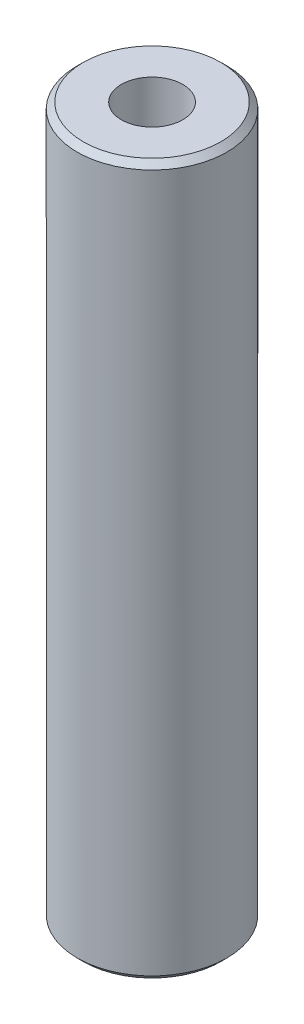
ISO-10303-21;
HEADER;
FILE_DESCRIPTION(('STEP AP214'),'2;1');
FILE_NAME('part.step','',(''),(''),'','','');
FILE_SCHEMA(('AUTOMOTIVE_DESIGN { 1 0 10303 214 1 1 1 1 }'));
ENDSEC;
DATA;
#1=APPLICATION_CONTEXT('core data for automotive mechanical design processes');
#2=APPLICATION_PROTOCOL_DEFINITION('international standard','automotive_design',2000,#1);
#3=PRODUCT_CONTEXT('',#1,'mechanical');
#4=PRODUCT('Part','Part','',(#3));
#5=PRODUCT_RELATED_PRODUCT_CATEGORY('part','',(#4));
#6=PRODUCT_DEFINITION_FORMATION('','',#4);
#7=PRODUCT_DEFINITION_CONTEXT('part definition',#1,'design');
#8=PRODUCT_DEFINITION('design','',#6,#7);
#9=PRODUCT_DEFINITION_SHAPE('','',#8);
#10=(LENGTH_UNIT() NAMED_UNIT(*) SI_UNIT(.MILLI.,.METRE.));
#11=(NAMED_UNIT(*) PLANE_ANGLE_UNIT() SI_UNIT($,.RADIAN.));
#12=(NAMED_UNIT(*) SI_UNIT($,.STERADIAN.) SOLID_ANGLE_UNIT());
#13=UNCERTAINTY_MEASURE_WITH_UNIT(LENGTH_MEASURE(1.E-05),#10,'distance_accuracy_value','');
#14=(GEOMETRIC_REPRESENTATION_CONTEXT(3) GLOBAL_UNCERTAINTY_ASSIGNED_CONTEXT((#13)) GLOBAL_UNIT_ASSIGNED_CONTEXT((#10,
#11,#12)) REPRESENTATION_CONTEXT('',''));
#15=CARTESIAN_POINT('',(0.,0.,0.));
#16=DIRECTION('',(0.,0.,1.));
#17=DIRECTION('',(1.,0.,0.));
#18=AXIS2_PLACEMENT_3D('',#15,#16,#17);
#19=CARTESIAN_POINT('',(0.,498.019441746337,0.));
#20=DIRECTION('',(0.,-1.,0.));
#21=DIRECTION('',(0.,0.,-1.));
#22=AXIS2_PLACEMENT_3D('',#19,#20,#21);
#23=CYLINDRICAL_SURFACE('',#22,52.5);
#24=CARTESIAN_POINT('',(0.,493.83195839929,0.));
#25=DIRECTION('',(0.,1.,0.));
#26=DIRECTION('',(0.,0.,1.));
#27=AXIS2_PLACEMENT_3D('',#24,#25,#26);
#28=CIRCLE('',#27,52.5);
#29=CARTESIAN_POINT('',(0.,493.83195839929,-52.5));
#30=VERTEX_POINT('',#29);
#31=EDGE_CURVE('E50',#30,#30,#28,.F.);
#32=CARTESIAN_POINT('',(0.,4.22720343473615,0.));
#33=DIRECTION('',(0.,1.,0.));
#34=DIRECTION('',(0.,0.,1.));
#35=AXIS2_PLACEMENT_3D('',#32,#33,#34);
#36=CIRCLE('',#35,52.5);
#37=CARTESIAN_POINT('',(0.,4.22720343473615,-52.5));
#38=VERTEX_POINT('',#37);
#39=EDGE_CURVE('E51',#38,#38,#36,.T.);
#40=CARTESIAN_POINT('',(0.,493.83195839929,-52.5));
#41=CARTESIAN_POINT('',(0.,488.731908868409,-52.5));
#42=CARTESIAN_POINT('',(0.,483.631859337528,-52.5));
#43=CARTESIAN_POINT('',(0.,473.431760275767,-52.5));
#44=CARTESIAN_POINT('',(0.,468.331710744886,-52.5));
#45=CARTESIAN_POINT('',(0.,458.131611683124,-52.5));
#46=CARTESIAN_POINT('',(0.,453.031562152244,-52.5));
#47=CARTESIAN_POINT('',(0.,442.831463090482,-52.5));
#48=CARTESIAN_POINT('',(0.,437.731413559601,-52.5));
#49=CARTESIAN_POINT('',(0.,427.53131449784,-52.5));
#50=CARTESIAN_POINT('',(0.,422.431264966959,-52.5));
#51=CARTESIAN_POINT('',(0.,412.231165905197,-52.5));
#52=CARTESIAN_POINT('',(0.,407.131116374317,-52.5));
#53=CARTESIAN_POINT('',(0.,396.931017312555,-52.5));
#54=CARTESIAN_POINT('',(0.,391.830967781674,-52.5));
#55=CARTESIAN_POINT('',(0.,381.630868719913,-52.5));
#56=CARTESIAN_POINT('',(0.,376.530819189032,-52.5));
#57=CARTESIAN_POINT('',(0.,366.33072012727,-52.5));
#58=CARTESIAN_POINT('',(0.,361.23067059639,-52.5));
#59=CARTESIAN_POINT('',(0.,351.030571534628,-52.5));
#60=CARTESIAN_POINT('',(0.,345.930522003747,-52.5));
#61=CARTESIAN_POINT('',(0.,335.730422941986,-52.5));
#62=CARTESIAN_POINT('',(0.,330.630373411105,-52.5));
#63=CARTESIAN_POINT('',(0.,320.430274349344,-52.5));
#64=CARTESIAN_POINT('',(0.,315.330224818463,-52.5));
#65=CARTESIAN_POINT('',(0.,305.130125756701,-52.5));
#66=CARTESIAN_POINT('',(0.,300.030076225821,-52.5));
#67=CARTESIAN_POINT('',(0.,289.829977164059,-52.5));
#68=CARTESIAN_POINT('',(0.,284.729927633178,-52.5));
#69=CARTESIAN_POINT('',(0.,274.529828571417,-52.5));
#70=CARTESIAN_POINT('',(0.,269.429779040536,-52.5));
#71=CARTESIAN_POINT('',(0.,259.229679978774,-52.5));
#72=CARTESIAN_POINT('',(0.,254.129630447894,-52.5));
#73=CARTESIAN_POINT('',(0.,243.929531386132,-52.5));
#74=CARTESIAN_POINT('',(0.,238.829481855251,-52.5));
#75=CARTESIAN_POINT('',(0.,228.62938279349,-52.5));
#76=CARTESIAN_POINT('',(0.,223.529333262609,-52.5));
#77=CARTESIAN_POINT('',(0.,213.329234200848,-52.5));
#78=CARTESIAN_POINT('',(0.,208.229184669967,-52.5));
#79=CARTESIAN_POINT('',(0.,198.029085608205,-52.5));
#80=CARTESIAN_POINT('',(0.,192.929036077324,-52.5));
#81=CARTESIAN_POINT('',(0.,182.728937015563,-52.5));
#82=CARTESIAN_POINT('',(0.,177.628887484682,-52.5));
#83=CARTESIAN_POINT('',(0.,167.428788422921,-52.5));
#84=CARTESIAN_POINT('',(0.,162.32873889204,-52.5));
#85=CARTESIAN_POINT('',(0.,152.128639830278,-52.5));
#86=CARTESIAN_POINT('',(0.,147.028590299398,-52.5));
#87=CARTESIAN_POINT('',(0.,136.828491237636,-52.5));
#88=CARTESIAN_POINT('',(0.,131.728441706755,-52.5));
#89=CARTESIAN_POINT('',(0.,121.528342644994,-52.5));
#90=CARTESIAN_POINT('',(0.,116.428293114113,-52.5));
#91=CARTESIAN_POINT('',(0.,106.228194052351,-52.5));
#92=CARTESIAN_POINT('',(0.,101.128144521471,-52.5));
#93=CARTESIAN_POINT('',(0.,90.9280454597092,-52.5));
#94=CARTESIAN_POINT('',(0.,85.8279959288284,-52.5));
#95=CARTESIAN_POINT('',(0.,75.6278968670669,-52.5));
#96=CARTESIAN_POINT('',(0.,70.5278473361861,-52.5));
#97=CARTESIAN_POINT('',(0.,60.3277482744245,-52.5));
#98=CARTESIAN_POINT('',(0.,55.2276987435438,-52.5));
#99=CARTESIAN_POINT('',(0.,45.0275996817822,-52.5));
#100=CARTESIAN_POINT('',(0.,39.9275501509015,-52.5));
#101=CARTESIAN_POINT('',(0.,29.72745108914,-52.5));
#102=CARTESIAN_POINT('',(0.,24.6274015582592,-52.5));
#103=CARTESIAN_POINT('',(0.,14.4273024964977,-52.5));
#104=CARTESIAN_POINT('',(0.,9.3272529656169,-52.5));
#105=CARTESIAN_POINT('',(0.,4.22720343473615,-52.5));
#106=B_SPLINE_CURVE_WITH_KNOTS('',3,(#40,#41,#42,#43,#44,#45,#46,#47,#48,#49,#50,#51,#52,#53,
#54,#55,#56,#57,#58,#59,#60,#61,#62,#63,#64,#65,#66,#67,#68,#69,#70,#71,#72,#73,#74,#75,#76,#77,
#78,#79,#80,#81,#82,#83,#84,#85,#86,#87,#88,#89,#90,#91,#92,#93,#94,#95,#96,#97,#98,#99,#100,
#101,#102,#103,#104,#105),.UNSPECIFIED.,.F.,.F.,(4,2,2,2,2,2,2,2,2,2,2,2,2,2,2,2,2,2,2,2,2,2,2,
2,2,2,2,2,2,2,2,2,4),(0.,15.3001485926423,30.6002971852846,45.9004457779269,61.2005943705692,
76.5007429632115,91.8008915558538,107.101040148496,122.401188741138,137.701337333781,
153.001485926423,168.301634519065,183.601783111708,198.90193170435,214.202080296992,
229.502228889634,244.802377482277,260.102526074919,275.402674667561,290.702823260204,
306.002971852846,321.303120445488,336.603269038131,351.903417630773,367.203566223415,
382.503714816057,397.8038634087,413.104012001342,428.404160593984,443.704309186627,
459.004457779269,474.304606371911,489.604754964554),.UNSPECIFIED.);
#107=EDGE_CURVE('BSEAM39',#30,#38,#106,.T.);
#108=ORIENTED_EDGE('',*,*,#31,.T.);
#109=ORIENTED_EDGE('',*,*,#39,.T.);
#110=ORIENTED_EDGE('',*,*,#107,.T.);
#111=ORIENTED_EDGE('',*,*,#107,.F.);
#112=EDGE_LOOP('',(#108,#110,#109,#111));
#113=FACE_BOUND('',#112,.T.);
#114=ADVANCED_FACE('F39',(#113),#23,.T.);
#115=CARTESIAN_POINT('',(0.,498.019441746337,0.));
#116=DIRECTION('',(0.,1.,0.));
#117=DIRECTION('',(0.,0.,1.));
#118=AXIS2_PLACEMENT_3D('',#115,#116,#117);
#119=PLANE('',#118);
#120=CARTESIAN_POINT('',(0.,498.019441746337,0.));
#121=DIRECTION('',(0.,1.,0.));
#122=DIRECTION('',(0.,0.,1.));
#123=AXIS2_PLACEMENT_3D('',#120,#121,#122);
#124=CIRCLE('',#123,48.2727965652642);
#125=CARTESIAN_POINT('',(0.,498.019441746337,48.2727965652642));
#126=VERTEX_POINT('',#125);
#127=EDGE_CURVE('E54',#126,#126,#124,.T.);
#128=ORIENTED_EDGE('',*,*,#127,.T.);
#129=EDGE_LOOP('',(#128));
#130=FACE_BOUND('',#129,.T.);
#131=CARTESIAN_POINT('',(0.,498.019441746337,0.));
#132=DIRECTION('',(0.,1.,0.));
#133=DIRECTION('',(0.,0.,1.));
#134=AXIS2_PLACEMENT_3D('',#131,#132,#133);
#135=CIRCLE('',#134,21.5320785406504);
#136=CARTESIAN_POINT('',(0.,498.019441746337,-21.5320785406504));
#137=VERTEX_POINT('',#136);
#138=EDGE_CURVE('E58',#137,#137,#135,.T.);
#139=ORIENTED_EDGE('',*,*,#138,.F.);
#140=EDGE_LOOP('',(#139));
#141=FACE_BOUND('',#140,.T.);
#142=ADVANCED_FACE('F69',(#130,#141),#119,.T.);
#143=CARTESIAN_POINT('',(0.,0.,0.));
#144=DIRECTION('',(0.,1.,0.));
#145=DIRECTION('',(0.,0.,1.));
#146=AXIS2_PLACEMENT_3D('',#143,#144,#145);
#147=PLANE('',#146);
#148=CARTESIAN_POINT('',(0.,0.,0.));
#149=DIRECTION('',(0.,1.,0.));
#150=DIRECTION('',(0.,0.,1.));
#151=AXIS2_PLACEMENT_3D('',#148,#149,#150);
#152=CIRCLE('',#151,48.312516652952);
#153=CARTESIAN_POINT('',(0.,0.,48.312516652952));
#154=VERTEX_POINT('',#153);
#155=EDGE_CURVE('E10',#154,#154,#152,.F.);
#156=ORIENTED_EDGE('',*,*,#155,.T.);
#157=EDGE_LOOP('',(#156));
#158=FACE_BOUND('',#157,.T.);
#159=CARTESIAN_POINT('',(0.,0.,0.));
#160=DIRECTION('',(0.,1.,0.));
#161=DIRECTION('',(0.,0.,1.));
#162=AXIS2_PLACEMENT_3D('',#159,#160,#161);
#163=CIRCLE('',#162,21.5320785406504);
#164=CARTESIAN_POINT('',(0.,0.,-21.5320785406504));
#165=VERTEX_POINT('',#164);
#166=EDGE_CURVE('E63',#165,#165,#163,.T.);
#167=ORIENTED_EDGE('',*,*,#166,.T.);
#168=EDGE_LOOP('',(#167));
#169=FACE_BOUND('',#168,.T.);
#170=ADVANCED_FACE('F75',(#158,#169),#147,.F.);
#171=CARTESIAN_POINT('',(0.,498.019441746337,0.));
#172=DIRECTION('',(0.,-1.,0.));
#173=DIRECTION('',(0.,0.,-1.));
#174=AXIS2_PLACEMENT_3D('',#171,#172,#173);
#175=CYLINDRICAL_SURFACE('',#174,21.5320785406504);
#176=CARTESIAN_POINT('',(0.,498.019441746337,-21.5320785406504));
#177=CARTESIAN_POINT('',(0.,492.831739228146,-21.5320785406504));
#178=CARTESIAN_POINT('',(0.,487.644036709955,-21.5320785406504));
#179=CARTESIAN_POINT('',(0.,477.268631673573,-21.5320785406504));
#180=CARTESIAN_POINT('',(0.,472.080929155382,-21.5320785406504));
#181=CARTESIAN_POINT('',(0.,461.705524119,-21.5320785406504));
#182=CARTESIAN_POINT('',(0.,456.517821600809,-21.5320785406504));
#183=CARTESIAN_POINT('',(0.,446.142416564427,-21.5320785406504));
#184=CARTESIAN_POINT('',(0.,440.954714046236,-21.5320785406504));
#185=CARTESIAN_POINT('',(0.,430.579309009854,-21.5320785406504));
#186=CARTESIAN_POINT('',(0.,425.391606491663,-21.5320785406504));
#187=CARTESIAN_POINT('',(0.,415.016201455281,-21.5320785406504));
#188=CARTESIAN_POINT('',(0.,409.82849893709,-21.5320785406504));
#189=CARTESIAN_POINT('',(0.,399.453093900708,-21.5320785406504));
#190=CARTESIAN_POINT('',(0.,394.265391382517,-21.5320785406504));
#191=CARTESIAN_POINT('',(0.,383.889986346135,-21.5320785406504));
#192=CARTESIAN_POINT('',(0.,378.702283827944,-21.5320785406504));
#193=CARTESIAN_POINT('',(0.,368.326878791562,-21.5320785406504));
#194=CARTESIAN_POINT('',(0.,363.139176273371,-21.5320785406504));
#195=CARTESIAN_POINT('',(0.,352.763771236989,-21.5320785406504));
#196=CARTESIAN_POINT('',(0.,347.576068718798,-21.5320785406504));
#197=CARTESIAN_POINT('',(0.,337.200663682416,-21.5320785406504));
#198=CARTESIAN_POINT('',(0.,332.012961164225,-21.5320785406504));
#199=CARTESIAN_POINT('',(0.,321.637556127843,-21.5320785406504));
#200=CARTESIAN_POINT('',(0.,316.449853609652,-21.5320785406504));
#201=CARTESIAN_POINT('',(0.,306.07444857327,-21.5320785406504));
#202=CARTESIAN_POINT('',(0.,300.886746055079,-21.5320785406504));
#203=CARTESIAN_POINT('',(0.,290.511341018697,-21.5320785406504));
#204=CARTESIAN_POINT('',(0.,285.323638500506,-21.5320785406504));
#205=CARTESIAN_POINT('',(0.,274.948233464124,-21.5320785406504));
#206=CARTESIAN_POINT('',(0.,269.760530945933,-21.5320785406504));
#207=CARTESIAN_POINT('',(0.,259.385125909551,-21.5320785406504));
#208=CARTESIAN_POINT('',(0.,254.19742339136,-21.5320785406504));
#209=CARTESIAN_POINT('',(0.,243.822018354978,-21.5320785406504));
#210=CARTESIAN_POINT('',(0.,238.634315836787,-21.5320785406504));
#211=CARTESIAN_POINT('',(0.,228.258910800405,-21.5320785406504));
#212=CARTESIAN_POINT('',(0.,223.071208282214,-21.5320785406504));
#213=CARTESIAN_POINT('',(0.,212.695803245832,-21.5320785406504));
#214=CARTESIAN_POINT('',(0.,207.508100727641,-21.5320785406504));
#215=CARTESIAN_POINT('',(0.,197.132695691259,-21.5320785406504));
#216=CARTESIAN_POINT('',(0.,191.944993173067,-21.5320785406504));
#217=CARTESIAN_POINT('',(0.,181.569588136685,-21.5320785406504));
#218=CARTESIAN_POINT('',(0.,176.381885618494,-21.5320785406504));
#219=CARTESIAN_POINT('',(0.,166.006480582112,-21.5320785406504));
#220=CARTESIAN_POINT('',(0.,160.818778063921,-21.5320785406504));
#221=CARTESIAN_POINT('',(0.,150.443373027539,-21.5320785406504));
#222=CARTESIAN_POINT('',(0.,145.255670509348,-21.5320785406504));
#223=CARTESIAN_POINT('',(0.,134.880265472966,-21.5320785406504));
#224=CARTESIAN_POINT('',(0.,129.692562954775,-21.5320785406504));
#225=CARTESIAN_POINT('',(0.,119.317157918393,-21.5320785406504));
#226=CARTESIAN_POINT('',(0.,114.129455400202,-21.5320785406504));
#227=CARTESIAN_POINT('',(0.,103.75405036382,-21.5320785406504));
#228=CARTESIAN_POINT('',(0.,98.5663478456293,-21.5320785406504));
#229=CARTESIAN_POINT('',(0.,88.1909428092472,-21.5320785406504));
#230=CARTESIAN_POINT('',(0.,83.0032402910562,-21.5320785406504));
#231=CARTESIAN_POINT('',(0.,72.6278352546742,-21.5320785406504));
#232=CARTESIAN_POINT('',(0.,67.4401327364832,-21.5320785406504));
#233=CARTESIAN_POINT('',(0.,57.0647277001012,-21.5320785406504));
#234=CARTESIAN_POINT('',(0.,51.8770251819101,-21.5320785406504));
#235=CARTESIAN_POINT('',(0.,41.5016201455281,-21.5320785406504));
#236=CARTESIAN_POINT('',(0.,36.3139176273371,-21.5320785406504));
#237=CARTESIAN_POINT('',(0.,25.9385125909551,-21.5320785406504));
#238=CARTESIAN_POINT('',(0.,20.750810072764,-21.5320785406504));
#239=CARTESIAN_POINT('',(0.,10.375405036382,-21.5320785406504));
#240=CARTESIAN_POINT('',(0.,5.18770251819101,-21.5320785406504));
#241=CARTESIAN_POINT('',(0.,0.,-21.5320785406504));
#242=B_SPLINE_CURVE_WITH_KNOTS('',3,(#176,#177,#178,#179,#180,#181,#182,#183,#184,#185,#186,
#187,#188,#189,#190,#191,#192,#193,#194,#195,#196,#197,#198,#199,#200,#201,#202,#203,#204,#205,
#206,#207,#208,#209,#210,#211,#212,#213,#214,#215,#216,#217,#218,#219,#220,#221,#222,#223,#224,
#225,#226,#227,#228,#229,#230,#231,#232,#233,#234,#235,#236,#237,#238,#239,#240,#241),
.UNSPECIFIED.,.F.,.F.,(4,2,2,2,2,2,2,2,2,2,2,2,2,2,2,2,2,2,2,2,2,2,2,2,2,2,2,2,2,2,2,2,4),(0.,
15.5631075545731,31.1262151091461,46.6893226637191,62.2524302182922,77.8155377728652,
93.3786453274383,108.941752882011,124.504860436584,140.067967991157,155.63107554573,
171.194183100303,186.757290654876,202.32039820945,217.883505764023,233.446613318596,
249.009720873169,264.572828427742,280.135935982315,295.699043536888,311.262151091461,
326.825258646034,342.388366200607,357.95147375518,373.514581309753,389.077688864326,
404.640796418899,420.203903973472,435.767011528045,451.330119082618,466.893226637191,
482.456334191764,498.019441746337),.UNSPECIFIED.);
#243=EDGE_CURVE('BSEAM70',#137,#165,#242,.T.);
#244=ORIENTED_EDGE('',*,*,#138,.T.);
#245=ORIENTED_EDGE('',*,*,#166,.F.);
#246=ORIENTED_EDGE('',*,*,#243,.T.);
#247=ORIENTED_EDGE('',*,*,#243,.F.);
#248=EDGE_LOOP('',(#244,#246,#245,#247));
#249=FACE_BOUND('',#248,.T.);
#250=ADVANCED_FACE('F70',(#249),#175,.F.);
#251=CARTESIAN_POINT('',(0.,498.019441746337,0.));
#252=DIRECTION('',(0.,-1.,0.));
#253=DIRECTION('',(0.,0.,-1.));
#254=AXIS2_PLACEMENT_3D('',#251,#252,#253);
#255=CONICAL_SURFACE('',#254,48.2727965652642,0.790118457059526);
#256=ORIENTED_EDGE('',*,*,#31,.F.);
#257=EDGE_LOOP('',(#256));
#258=FACE_BOUND('',#257,.T.);
#259=ORIENTED_EDGE('',*,*,#127,.F.);
#260=EDGE_LOOP('',(#259));
#261=FACE_BOUND('',#260,.T.);
#262=ADVANCED_FACE('F81',(#258,#261),#255,.T.);
#263=CARTESIAN_POINT('',(0.,4.22720343473615,0.));
#264=DIRECTION('',(0.,1.,0.));
#265=DIRECTION('',(0.,0.,1.));
#266=AXIS2_PLACEMENT_3D('',#263,#264,#265);
#267=CONICAL_SURFACE('',#266,52.5,0.780677869735375);
#268=ORIENTED_EDGE('',*,*,#155,.F.);
#269=EDGE_LOOP('',(#268));
#270=FACE_BOUND('',#269,.T.);
#271=ORIENTED_EDGE('',*,*,#39,.F.);
#272=EDGE_LOOP('',(#271));
#273=FACE_BOUND('',#272,.T.);
#274=ADVANCED_FACE('F45',(#270,#273),#267,.T.);
#275=CLOSED_SHELL('',(#114,#142,#170,#250,#262,#274));
#276=MANIFOLD_SOLID_BREP('B2',#275);
#277=ADVANCED_BREP_SHAPE_REPRESENTATION('',(#18,#276),#14);
#278=SHAPE_DEFINITION_REPRESENTATION(#9,#277);
ENDSEC;
END-ISO-10303-21;
